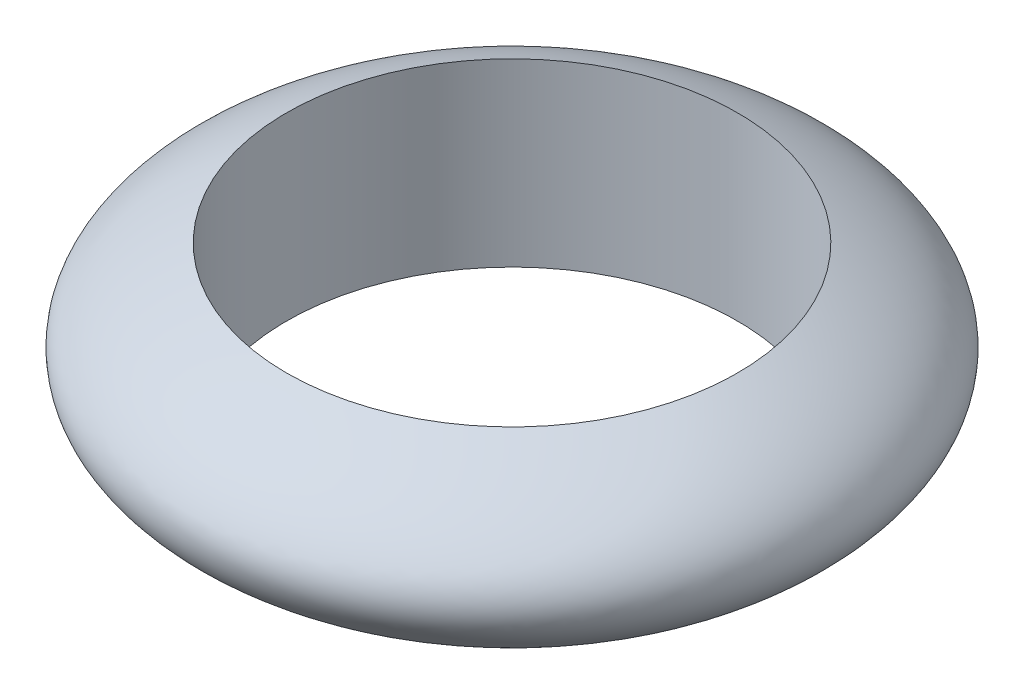
ISO-10303-21;
HEADER;
FILE_DESCRIPTION(('STEP AP214'),'2;1');
FILE_NAME('part.step','',(''),(''),'','','');
FILE_SCHEMA(('AUTOMOTIVE_DESIGN { 1 0 10303 214 1 1 1 1 }'));
ENDSEC;
DATA;
#1=APPLICATION_CONTEXT('core data for automotive mechanical design processes');
#2=APPLICATION_PROTOCOL_DEFINITION('international standard','automotive_design',2000,#1);
#3=PRODUCT_CONTEXT('',#1,'mechanical');
#4=PRODUCT('Part','Part','',(#3));
#5=PRODUCT_RELATED_PRODUCT_CATEGORY('part','',(#4));
#6=PRODUCT_DEFINITION_FORMATION('','',#4);
#7=PRODUCT_DEFINITION_CONTEXT('part definition',#1,'design');
#8=PRODUCT_DEFINITION('design','',#6,#7);
#9=PRODUCT_DEFINITION_SHAPE('','',#8);
#10=(LENGTH_UNIT() NAMED_UNIT(*) SI_UNIT(.MILLI.,.METRE.));
#11=(NAMED_UNIT(*) PLANE_ANGLE_UNIT() SI_UNIT($,.RADIAN.));
#12=(NAMED_UNIT(*) SI_UNIT($,.STERADIAN.) SOLID_ANGLE_UNIT());
#13=UNCERTAINTY_MEASURE_WITH_UNIT(LENGTH_MEASURE(1.E-05),#10,'distance_accuracy_value','');
#14=(GEOMETRIC_REPRESENTATION_CONTEXT(3) GLOBAL_UNCERTAINTY_ASSIGNED_CONTEXT((#13)) GLOBAL_UNIT_ASSIGNED_CONTEXT((#10,
#11,#12)) REPRESENTATION_CONTEXT('',''));
#15=CARTESIAN_POINT('',(0.,0.,0.));
#16=DIRECTION('',(0.,0.,1.));
#17=DIRECTION('',(1.,0.,0.));
#18=AXIS2_PLACEMENT_3D('',#15,#16,#17);
#19=CARTESIAN_POINT('',(0.,36.1029411764706,0.));
#20=DIRECTION('',(0.,1.,0.));
#21=DIRECTION('',(0.,0.,1.));
#22=AXIS2_PLACEMENT_3D('',#19,#20,#21);
#23=CYLINDRICAL_SURFACE('',#22,12.5);
#24=CARTESIAN_POINT('',(0.,10.4411764705882,0.));
#25=DIRECTION('',(0.,1.,0.));
#26=DIRECTION('',(0.,0.,1.));
#27=AXIS2_PLACEMENT_3D('',#24,#25,#26);
#28=CIRCLE('',#27,12.5);
#29=CARTESIAN_POINT('',(0.,10.4411764705882,12.5));
#30=VERTEX_POINT('',#29);
#31=EDGE_CURVE('E10',#30,#30,#28,.T.);
#32=ORIENTED_EDGE('',*,*,#31,.T.);
#33=EDGE_LOOP('',(#32));
#34=FACE_BOUND('',#33,.T.);
#35=CARTESIAN_POINT('',(0.,0.441176470588237,0.));
#36=DIRECTION('',(0.,1.,0.));
#37=DIRECTION('',(0.,0.,1.));
#38=AXIS2_PLACEMENT_3D('',#35,#36,#37);
#39=CIRCLE('',#38,12.5);
#40=CARTESIAN_POINT('',(0.,0.441176470588237,12.5));
#41=VERTEX_POINT('',#40);
#42=EDGE_CURVE('E41',#41,#41,#39,.T.);
#43=ORIENTED_EDGE('',*,*,#42,.F.);
#44=EDGE_LOOP('',(#43));
#45=FACE_BOUND('',#44,.T.);
#46=ADVANCED_FACE('F35',(#34,#45),#23,.F.);
#47=CARTESIAN_POINT('',(-12.5,10.4411764705882,0.));
#48=CARTESIAN_POINT('',(-24.0441176470588,5.44117647058824,0.));
#49=CARTESIAN_POINT('',(-12.5,0.441176470588237,0.));
#50=B_SPLINE_CURVE_WITH_KNOTS('',2,(#47,#48,#49),.UNSPECIFIED.,.F.,.F.,(3,3),(0.,1.),.UNSPECIFIED.);
#51=CARTESIAN_POINT('',(0.,36.1029411764706,0.));
#52=DIRECTION('',(0.,1.,0.));
#53=AXIS1_PLACEMENT('',#51,#52);
#54=SURFACE_OF_REVOLUTION('',#50,#53);
#55=ORIENTED_EDGE('',*,*,#42,.T.);
#56=EDGE_LOOP('',(#55));
#57=FACE_BOUND('',#56,.T.);
#58=ORIENTED_EDGE('',*,*,#31,.F.);
#59=EDGE_LOOP('',(#58));
#60=FACE_BOUND('',#59,.T.);
#61=ADVANCED_FACE('F54',(#57,#60),#54,.F.);
#62=CLOSED_SHELL('',(#46,#61));
#63=MANIFOLD_SOLID_BREP('B2',#62);
#64=ADVANCED_BREP_SHAPE_REPRESENTATION('',(#18,#63),#14);
#65=SHAPE_DEFINITION_REPRESENTATION(#9,#64);
ENDSEC;
END-ISO-10303-21;
